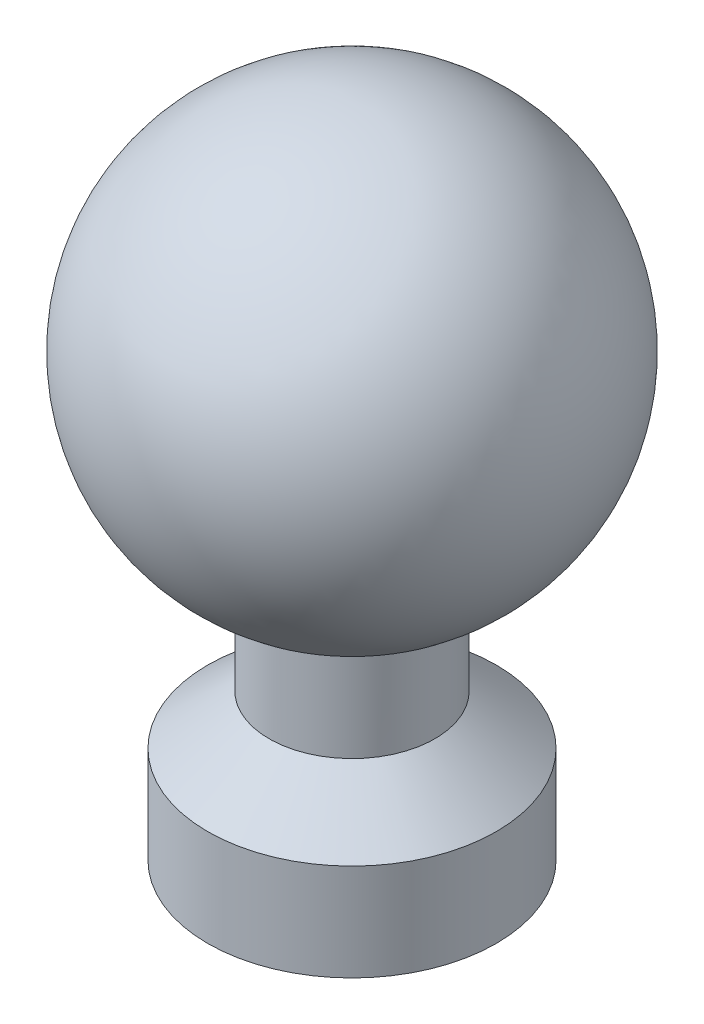
ISO-10303-21;
HEADER;
FILE_DESCRIPTION(('STEP AP214'),'2;1');
FILE_NAME('part.step','',(''),(''),'','','');
FILE_SCHEMA(('AUTOMOTIVE_DESIGN { 1 0 10303 214 1 1 1 1 }'));
ENDSEC;
DATA;
#1=APPLICATION_CONTEXT('core data for automotive mechanical design processes');
#2=APPLICATION_PROTOCOL_DEFINITION('international standard','automotive_design',2000,#1);
#3=PRODUCT_CONTEXT('',#1,'mechanical');
#4=PRODUCT('Part','Part','',(#3));
#5=PRODUCT_RELATED_PRODUCT_CATEGORY('part','',(#4));
#6=PRODUCT_DEFINITION_FORMATION('','',#4);
#7=PRODUCT_DEFINITION_CONTEXT('part definition',#1,'design');
#8=PRODUCT_DEFINITION('design','',#6,#7);
#9=PRODUCT_DEFINITION_SHAPE('','',#8);
#10=(LENGTH_UNIT() NAMED_UNIT(*) SI_UNIT(.MILLI.,.METRE.));
#11=(NAMED_UNIT(*) PLANE_ANGLE_UNIT() SI_UNIT($,.RADIAN.));
#12=(NAMED_UNIT(*) SI_UNIT($,.STERADIAN.) SOLID_ANGLE_UNIT());
#13=UNCERTAINTY_MEASURE_WITH_UNIT(LENGTH_MEASURE(1.E-05),#10,'distance_accuracy_value','');
#14=(GEOMETRIC_REPRESENTATION_CONTEXT(3) GLOBAL_UNCERTAINTY_ASSIGNED_CONTEXT((#13)) GLOBAL_UNIT_ASSIGNED_CONTEXT((#10,
#11,#12)) REPRESENTATION_CONTEXT('',''));
#15=CARTESIAN_POINT('',(0.,0.,0.));
#16=DIRECTION('',(0.,0.,1.));
#17=DIRECTION('',(1.,0.,0.));
#18=AXIS2_PLACEMENT_3D('',#15,#16,#17);
#19=CARTESIAN_POINT('',(0.,23.7326170408478,0.));
#20=DIRECTION('',(0.,1.,0.));
#21=DIRECTION('',(1.,0.,0.));
#22=AXIS2_PLACEMENT_3D('',#19,#20,#21);
#23=SPHERICAL_SURFACE('',#22,11.6294472842037);
#24=CARTESIAN_POINT('',(0.,35.3620643250515,0.));
#25=VERTEX_POINT('',#24);
#26=VERTEX_LOOP('',#25);
#27=FACE_BOUND('',#26,.T.);
#28=ADVANCED_FACE('F45',(#27),#23,.T.);
#29=OPEN_SHELL('',(#28));
#30=SHELL_BASED_SURFACE_MODEL('B2',(#29));
#31=CARTESIAN_POINT('',(0.,23.7326170408478,0.));
#32=DIRECTION('',(0.,1.,0.));
#33=DIRECTION('',(1.,0.,0.));
#34=AXIS2_PLACEMENT_3D('',#31,#32,#33);
#35=SPHERICAL_SURFACE('',#34,10.6294472842037);
#36=CARTESIAN_POINT('',(0.,14.0855531328292,0.));
#37=DIRECTION('',(0.,1.,0.));
#38=DIRECTION('',(-1.,0.,0.));
#39=AXIS2_PLACEMENT_3D('',#36,#37,#38);
#40=CIRCLE('',#39,4.46310514353718);
#41=CARTESIAN_POINT('',(-4.46310514353718,14.0855531328292,0.));
#42=VERTEX_POINT('',#41);
#43=EDGE_CURVE('E44',#42,#42,#40,.T.);
#44=ORIENTED_EDGE('',*,*,#43,.T.);
#45=EDGE_LOOP('',(#44));
#46=FACE_BOUND('',#45,.T.);
#47=ADVANCED_FACE('F59',(#46),#35,.T.);
#48=CARTESIAN_POINT('',(0.,34.3620643250515,0.));
#49=DIRECTION('',(0.,1.,0.));
#50=DIRECTION('',(-1.,0.,0.));
#51=AXIS2_PLACEMENT_3D('',#48,#49,#50);
#52=CYLINDRICAL_SURFACE('',#51,4.46310514353718);
#53=ORIENTED_EDGE('',*,*,#43,.F.);
#54=EDGE_LOOP('',(#53));
#55=FACE_BOUND('',#54,.T.);
#56=CARTESIAN_POINT('',(0.,7.89159431224164,0.));
#57=DIRECTION('',(0.,1.,0.));
#58=DIRECTION('',(-1.,0.,0.));
#59=AXIS2_PLACEMENT_3D('',#56,#57,#58);
#60=CIRCLE('',#59,4.46310514353718);
#61=CARTESIAN_POINT('',(-4.46310514353718,7.89159431224164,0.));
#62=VERTEX_POINT('',#61);
#63=EDGE_CURVE('E65',#62,#62,#60,.T.);
#64=ORIENTED_EDGE('',*,*,#63,.T.);
#65=EDGE_LOOP('',(#64));
#66=FACE_BOUND('',#65,.T.);
#67=ADVANCED_FACE('F91',(#55,#66),#52,.T.);
#68=CARTESIAN_POINT('',(0.,5.21659251213107,0.));
#69=DIRECTION('',(0.,-1.,0.));
#70=DIRECTION('',(1.,0.,0.));
#71=AXIS2_PLACEMENT_3D('',#68,#69,#70);
#72=CONICAL_SURFACE('',#71,7.77055153589078,0.890723638054857);
#73=ORIENTED_EDGE('',*,*,#63,.F.);
#74=EDGE_LOOP('',(#73));
#75=FACE_BOUND('',#74,.T.);
#76=CARTESIAN_POINT('',(0.,5.21659251213107,0.));
#77=DIRECTION('',(0.,1.,0.));
#78=DIRECTION('',(-1.,0.,0.));
#79=AXIS2_PLACEMENT_3D('',#76,#77,#78);
#80=CIRCLE('',#79,7.77055153589078);
#81=CARTESIAN_POINT('',(-7.77055153589078,5.21659251213107,0.));
#82=VERTEX_POINT('',#81);
#83=EDGE_CURVE('E69',#82,#82,#80,.T.);
#84=ORIENTED_EDGE('',*,*,#83,.T.);
#85=EDGE_LOOP('',(#84));
#86=FACE_BOUND('',#85,.T.);
#87=ADVANCED_FACE('F87',(#75,#86),#72,.T.);
#88=CARTESIAN_POINT('',(0.,34.3620643250515,0.));
#89=DIRECTION('',(0.,1.,0.));
#90=DIRECTION('',(-1.,0.,0.));
#91=AXIS2_PLACEMENT_3D('',#88,#89,#90);
#92=CYLINDRICAL_SURFACE('',#91,7.77055153589078);
#93=ORIENTED_EDGE('',*,*,#83,.F.);
#94=EDGE_LOOP('',(#93));
#95=FACE_BOUND('',#94,.T.);
#96=CARTESIAN_POINT('',(0.,0.,0.));
#97=DIRECTION('',(0.,1.,0.));
#98=DIRECTION('',(-1.,0.,0.));
#99=AXIS2_PLACEMENT_3D('',#96,#97,#98);
#100=CIRCLE('',#99,7.77055153589078);
#101=CARTESIAN_POINT('',(-7.77055153589078,0.,0.));
#102=VERTEX_POINT('',#101);
#103=EDGE_CURVE('E73',#102,#102,#100,.T.);
#104=ORIENTED_EDGE('',*,*,#103,.T.);
#105=EDGE_LOOP('',(#104));
#106=FACE_BOUND('',#105,.T.);
#107=ADVANCED_FACE('F79',(#95,#106),#92,.T.);
#108=CARTESIAN_POINT('',(7.77055153589078,0.,0.));
#109=DIRECTION('',(0.,1.,0.));
#110=DIRECTION('',(-1.,0.,0.));
#111=AXIS2_PLACEMENT_3D('',#108,#109,#110);
#112=PLANE('',#111);
#113=ORIENTED_EDGE('',*,*,#103,.F.);
#114=EDGE_LOOP('',(#113));
#115=FACE_BOUND('',#114,.T.);
#116=ADVANCED_FACE('F81',(#115),#112,.F.);
#117=CLOSED_SHELL('',(#47,#67,#87,#107,#116));
#118=MANIFOLD_SOLID_BREP('B6',#117);
#119=ADVANCED_BREP_SHAPE_REPRESENTATION('',(#18,#118),#14);
#120=MANIFOLD_SURFACE_SHAPE_REPRESENTATION('',(#18,#30),#14);
#121=SHAPE_REPRESENTATION('',(#18),#14);
#122=SHAPE_DEFINITION_REPRESENTATION(#9,#121);
#123=SHAPE_REPRESENTATION_RELATIONSHIP('','',#121,#119);
#124=SHAPE_REPRESENTATION_RELATIONSHIP('','',#121,#120);
ENDSEC;
END-ISO-10303-21;
